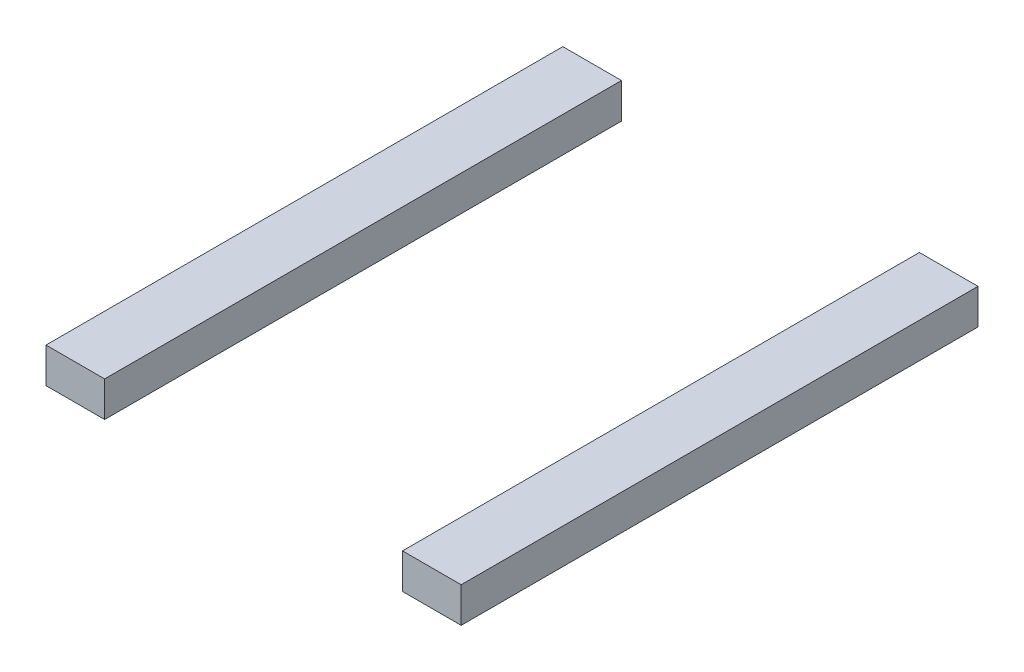
ISO-10303-21;
HEADER;
FILE_DESCRIPTION(('STEP AP214'),'2;1');
FILE_NAME('part.step','',(''),(''),'','','');
FILE_SCHEMA(('AUTOMOTIVE_DESIGN { 1 0 10303 214 1 1 1 1 }'));
ENDSEC;
DATA;
#1=APPLICATION_CONTEXT('core data for automotive mechanical design processes');
#2=APPLICATION_PROTOCOL_DEFINITION('international standard','automotive_design',2000,#1);
#3=PRODUCT_CONTEXT('',#1,'mechanical');
#4=PRODUCT('Part','Part','',(#3));
#5=PRODUCT_RELATED_PRODUCT_CATEGORY('part','',(#4));
#6=PRODUCT_DEFINITION_FORMATION('','',#4);
#7=PRODUCT_DEFINITION_CONTEXT('part definition',#1,'design');
#8=PRODUCT_DEFINITION('design','',#6,#7);
#9=PRODUCT_DEFINITION_SHAPE('','',#8);
#10=(LENGTH_UNIT() NAMED_UNIT(*) SI_UNIT(.MILLI.,.METRE.));
#11=(NAMED_UNIT(*) PLANE_ANGLE_UNIT() SI_UNIT($,.RADIAN.));
#12=(NAMED_UNIT(*) SI_UNIT($,.STERADIAN.) SOLID_ANGLE_UNIT());
#13=UNCERTAINTY_MEASURE_WITH_UNIT(LENGTH_MEASURE(1.E-05),#10,'distance_accuracy_value','');
#14=(GEOMETRIC_REPRESENTATION_CONTEXT(3) GLOBAL_UNCERTAINTY_ASSIGNED_CONTEXT((#13)) GLOBAL_UNIT_ASSIGNED_CONTEXT((#10,
#11,#12)) REPRESENTATION_CONTEXT('',''));
#15=CARTESIAN_POINT('',(0.,0.,0.));
#16=DIRECTION('',(0.,0.,1.));
#17=DIRECTION('',(1.,0.,0.));
#18=AXIS2_PLACEMENT_3D('',#15,#16,#17);
#19=CARTESIAN_POINT('',(-73.9960437855957,0.3,0.));
#20=DIRECTION('',(0.,0.,1.));
#21=DIRECTION('',(1.,0.,0.));
#22=AXIS2_PLACEMENT_3D('',#19,#20,#21);
#23=PLANE('',#22);
#24=DIRECTION('',(-1.,0.,0.));
#25=VECTOR('',#24,1.);
#26=CARTESIAN_POINT('',(-73.9960437855957,0.,0.));
#27=LINE('',#26,#25);
#28=CARTESIAN_POINT('',(-73.4960437855957,0.,0.));
#29=VERTEX_POINT('',#28);
#30=CARTESIAN_POINT('',(-73.9960437855957,0.,0.));
#31=VERTEX_POINT('',#30);
#32=EDGE_CURVE('E105',#29,#31,#27,.T.);
#33=ORIENTED_EDGE('',*,*,#32,.T.);
#34=DIRECTION('',(0.,-1.,0.));
#35=VECTOR('',#34,1.);
#36=CARTESIAN_POINT('',(-73.9960437855957,0.3,0.));
#37=LINE('',#36,#35);
#38=CARTESIAN_POINT('',(-73.9960437855957,0.3,0.));
#39=VERTEX_POINT('',#38);
#40=EDGE_CURVE('E12',#39,#31,#37,.T.);
#41=ORIENTED_EDGE('',*,*,#40,.F.);
#42=DIRECTION('',(-1.,0.,0.));
#43=VECTOR('',#42,1.);
#44=CARTESIAN_POINT('',(-73.9960437855957,0.3,0.));
#45=LINE('',#44,#43);
#46=CARTESIAN_POINT('',(-73.4960437855957,0.3,0.));
#47=VERTEX_POINT('',#46);
#48=EDGE_CURVE('E93',#47,#39,#45,.T.);
#49=ORIENTED_EDGE('',*,*,#48,.F.);
#50=DIRECTION('',(0.,-1.,0.));
#51=VECTOR('',#50,1.);
#52=CARTESIAN_POINT('',(-73.4960437855957,0.3,0.));
#53=LINE('',#52,#51);
#54=EDGE_CURVE('E101',#47,#29,#53,.T.);
#55=ORIENTED_EDGE('',*,*,#54,.T.);
#56=EDGE_LOOP('',(#33,#41,#49,#55));
#57=FACE_BOUND('',#56,.T.);
#58=ADVANCED_FACE('F42',(#57),#23,.F.);
#59=CARTESIAN_POINT('',(-73.9960437855957,0.3,0.));
#60=DIRECTION('',(1.,0.,0.));
#61=DIRECTION('',(0.,0.,-1.));
#62=AXIS2_PLACEMENT_3D('',#59,#60,#61);
#63=PLANE('',#62);
#64=DIRECTION('',(0.,0.,1.));
#65=VECTOR('',#64,1.);
#66=CARTESIAN_POINT('',(-73.9960437855957,0.,0.));
#67=LINE('',#66,#65);
#68=CARTESIAN_POINT('',(-73.9960437855957,0.,4.40709545593057));
#69=VERTEX_POINT('',#68);
#70=EDGE_CURVE('E97',#31,#69,#67,.T.);
#71=ORIENTED_EDGE('',*,*,#70,.T.);
#72=DIRECTION('',(0.,-1.,0.));
#73=VECTOR('',#72,1.);
#74=CARTESIAN_POINT('',(-73.9960437855957,0.3,4.40709545593057));
#75=LINE('',#74,#73);
#76=CARTESIAN_POINT('',(-73.9960437855957,0.3,4.40709545593057));
#77=VERTEX_POINT('',#76);
#78=EDGE_CURVE('E50',#77,#69,#75,.T.);
#79=ORIENTED_EDGE('',*,*,#78,.F.);
#80=DIRECTION('',(0.,0.,1.));
#81=VECTOR('',#80,1.);
#82=CARTESIAN_POINT('',(-73.9960437855957,0.3,0.));
#83=LINE('',#82,#81);
#84=EDGE_CURVE('E88',#39,#77,#83,.T.);
#85=ORIENTED_EDGE('',*,*,#84,.F.);
#86=ORIENTED_EDGE('',*,*,#40,.T.);
#87=EDGE_LOOP('',(#71,#79,#85,#86));
#88=FACE_BOUND('',#87,.T.);
#89=ADVANCED_FACE('F96',(#88),#63,.F.);
#90=CARTESIAN_POINT('',(-73.4960437855957,0.3,4.40709545593057));
#91=DIRECTION('',(0.,0.,-1.));
#92=DIRECTION('',(-1.,0.,0.));
#93=AXIS2_PLACEMENT_3D('',#90,#91,#92);
#94=PLANE('',#93);
#95=DIRECTION('',(1.,0.,0.));
#96=VECTOR('',#95,1.);
#97=CARTESIAN_POINT('',(-73.4960437855957,0.,4.40709545593057));
#98=LINE('',#97,#96);
#99=CARTESIAN_POINT('',(-73.4960437855957,0.,4.40709545593057));
#100=VERTEX_POINT('',#99);
#101=EDGE_CURVE('E75',#69,#100,#98,.T.);
#102=ORIENTED_EDGE('',*,*,#101,.T.);
#103=DIRECTION('',(0.,-1.,0.));
#104=VECTOR('',#103,1.);
#105=CARTESIAN_POINT('',(-73.4960437855957,0.3,4.40709545593057));
#106=LINE('',#105,#104);
#107=CARTESIAN_POINT('',(-73.4960437855957,0.3,4.40709545593057));
#108=VERTEX_POINT('',#107);
#109=EDGE_CURVE('E98',#108,#100,#106,.T.);
#110=ORIENTED_EDGE('',*,*,#109,.F.);
#111=DIRECTION('',(1.,0.,0.));
#112=VECTOR('',#111,1.);
#113=CARTESIAN_POINT('',(-73.4960437855957,0.3,4.40709545593057));
#114=LINE('',#113,#112);
#115=EDGE_CURVE('E91',#77,#108,#114,.T.);
#116=ORIENTED_EDGE('',*,*,#115,.F.);
#117=ORIENTED_EDGE('',*,*,#78,.T.);
#118=EDGE_LOOP('',(#102,#110,#116,#117));
#119=FACE_BOUND('',#118,.T.);
#120=ADVANCED_FACE('F99',(#119),#94,.F.);
#121=CARTESIAN_POINT('',(-73.4960437855957,0.3,0.));
#122=DIRECTION('',(-1.,0.,0.));
#123=DIRECTION('',(0.,0.,1.));
#124=AXIS2_PLACEMENT_3D('',#121,#122,#123);
#125=PLANE('',#124);
#126=DIRECTION('',(0.,0.,-1.));
#127=VECTOR('',#126,1.);
#128=CARTESIAN_POINT('',(-73.4960437855957,0.,0.));
#129=LINE('',#128,#127);
#130=EDGE_CURVE('E81',#100,#29,#129,.T.);
#131=ORIENTED_EDGE('',*,*,#130,.T.);
#132=ORIENTED_EDGE('',*,*,#54,.F.);
#133=DIRECTION('',(0.,0.,-1.));
#134=VECTOR('',#133,1.);
#135=CARTESIAN_POINT('',(-73.4960437855957,0.3,0.));
#136=LINE('',#135,#134);
#137=EDGE_CURVE('E58',#108,#47,#136,.T.);
#138=ORIENTED_EDGE('',*,*,#137,.F.);
#139=ORIENTED_EDGE('',*,*,#109,.T.);
#140=EDGE_LOOP('',(#131,#132,#138,#139));
#141=FACE_BOUND('',#140,.T.);
#142=ADVANCED_FACE('F112',(#141),#125,.F.);
#143=CARTESIAN_POINT('',(0.,0.3,0.));
#144=DIRECTION('',(0.,-1.,0.));
#145=DIRECTION('',(0.,0.,-1.));
#146=AXIS2_PLACEMENT_3D('',#143,#144,#145);
#147=PLANE('',#146);
#148=ORIENTED_EDGE('',*,*,#48,.T.);
#149=ORIENTED_EDGE('',*,*,#84,.T.);
#150=ORIENTED_EDGE('',*,*,#115,.T.);
#151=ORIENTED_EDGE('',*,*,#137,.T.);
#152=EDGE_LOOP('',(#148,#149,#150,#151));
#153=FACE_BOUND('',#152,.T.);
#154=ADVANCED_FACE('F89',(#153),#147,.F.);
#155=CARTESIAN_POINT('',(0.,0.,0.));
#156=DIRECTION('',(0.,-1.,0.));
#157=DIRECTION('',(0.,0.,-1.));
#158=AXIS2_PLACEMENT_3D('',#155,#156,#157);
#159=PLANE('',#158);
#160=ORIENTED_EDGE('',*,*,#32,.F.);
#161=ORIENTED_EDGE('',*,*,#130,.F.);
#162=ORIENTED_EDGE('',*,*,#101,.F.);
#163=ORIENTED_EDGE('',*,*,#70,.F.);
#164=EDGE_LOOP('',(#160,#161,#162,#163));
#165=FACE_BOUND('',#164,.T.);
#166=ADVANCED_FACE('F115',(#165),#159,.T.);
#167=CLOSED_SHELL('',(#58,#89,#120,#142,#154,#166));
#168=MANIFOLD_SOLID_BREP('B2',#167);
#169=CARTESIAN_POINT('',(-77.0360437855957,0.3,4.40709545593057));
#170=DIRECTION('',(1.,0.,0.));
#171=DIRECTION('',(0.,0.,-1.));
#172=AXIS2_PLACEMENT_3D('',#169,#170,#171);
#173=PLANE('',#172);
#174=DIRECTION('',(0.,0.,1.));
#175=VECTOR('',#174,1.);
#176=CARTESIAN_POINT('',(-77.0360437855957,0.,4.40709545593057));
#177=LINE('',#176,#175);
#178=CARTESIAN_POINT('',(-77.0360437855957,0.,0.));
#179=VERTEX_POINT('',#178);
#180=CARTESIAN_POINT('',(-77.0360437855957,0.,4.40709545593057));
#181=VERTEX_POINT('',#180);
#182=EDGE_CURVE('E228',#179,#181,#177,.T.);
#183=ORIENTED_EDGE('',*,*,#182,.T.);
#184=DIRECTION('',(0.,-1.,0.));
#185=VECTOR('',#184,1.);
#186=CARTESIAN_POINT('',(-77.0360437855957,0.3,4.40709545593057));
#187=LINE('',#186,#185);
#188=CARTESIAN_POINT('',(-77.0360437855957,0.3,4.40709545593057));
#189=VERTEX_POINT('',#188);
#190=EDGE_CURVE('E40',#189,#181,#187,.T.);
#191=ORIENTED_EDGE('',*,*,#190,.F.);
#192=DIRECTION('',(0.,0.,1.));
#193=VECTOR('',#192,1.);
#194=CARTESIAN_POINT('',(-77.0360437855957,0.3,4.40709545593057));
#195=LINE('',#194,#193);
#196=CARTESIAN_POINT('',(-77.0360437855957,0.3,0.));
#197=VERTEX_POINT('',#196);
#198=EDGE_CURVE('E216',#197,#189,#195,.T.);
#199=ORIENTED_EDGE('',*,*,#198,.F.);
#200=DIRECTION('',(0.,-1.,0.));
#201=VECTOR('',#200,1.);
#202=CARTESIAN_POINT('',(-77.0360437855957,0.3,0.));
#203=LINE('',#202,#201);
#204=EDGE_CURVE('E224',#197,#179,#203,.T.);
#205=ORIENTED_EDGE('',*,*,#204,.T.);
#206=EDGE_LOOP('',(#183,#191,#199,#205));
#207=FACE_BOUND('',#206,.T.);
#208=ADVANCED_FACE('F165',(#207),#173,.F.);
#209=CARTESIAN_POINT('',(-76.5360437855957,0.3,4.40709545593057));
#210=DIRECTION('',(0.,0.,-1.));
#211=DIRECTION('',(-1.,0.,0.));
#212=AXIS2_PLACEMENT_3D('',#209,#210,#211);
#213=PLANE('',#212);
#214=DIRECTION('',(1.,0.,0.));
#215=VECTOR('',#214,1.);
#216=CARTESIAN_POINT('',(-76.5360437855957,0.,4.40709545593057));
#217=LINE('',#216,#215);
#218=CARTESIAN_POINT('',(-76.5360437855957,0.,4.40709545593057));
#219=VERTEX_POINT('',#218);
#220=EDGE_CURVE('E220',#181,#219,#217,.T.);
#221=ORIENTED_EDGE('',*,*,#220,.T.);
#222=DIRECTION('',(0.,-1.,0.));
#223=VECTOR('',#222,1.);
#224=CARTESIAN_POINT('',(-76.5360437855957,0.3,4.40709545593057));
#225=LINE('',#224,#223);
#226=CARTESIAN_POINT('',(-76.5360437855957,0.3,4.40709545593057));
#227=VERTEX_POINT('',#226);
#228=EDGE_CURVE('E173',#227,#219,#225,.T.);
#229=ORIENTED_EDGE('',*,*,#228,.F.);
#230=DIRECTION('',(1.,0.,0.));
#231=VECTOR('',#230,1.);
#232=CARTESIAN_POINT('',(-76.5360437855957,0.3,4.40709545593057));
#233=LINE('',#232,#231);
#234=EDGE_CURVE('E211',#189,#227,#233,.T.);
#235=ORIENTED_EDGE('',*,*,#234,.F.);
#236=ORIENTED_EDGE('',*,*,#190,.T.);
#237=EDGE_LOOP('',(#221,#229,#235,#236));
#238=FACE_BOUND('',#237,.T.);
#239=ADVANCED_FACE('F219',(#238),#213,.F.);
#240=CARTESIAN_POINT('',(-76.5360437855957,0.3,0.));
#241=DIRECTION('',(-1.,0.,0.));
#242=DIRECTION('',(0.,0.,1.));
#243=AXIS2_PLACEMENT_3D('',#240,#241,#242);
#244=PLANE('',#243);
#245=DIRECTION('',(0.,0.,-1.));
#246=VECTOR('',#245,1.);
#247=CARTESIAN_POINT('',(-76.5360437855957,0.,0.));
#248=LINE('',#247,#246);
#249=CARTESIAN_POINT('',(-76.5360437855957,0.,0.));
#250=VERTEX_POINT('',#249);
#251=EDGE_CURVE('E198',#219,#250,#248,.T.);
#252=ORIENTED_EDGE('',*,*,#251,.T.);
#253=DIRECTION('',(0.,-1.,0.));
#254=VECTOR('',#253,1.);
#255=CARTESIAN_POINT('',(-76.5360437855957,0.3,0.));
#256=LINE('',#255,#254);
#257=CARTESIAN_POINT('',(-76.5360437855957,0.3,0.));
#258=VERTEX_POINT('',#257);
#259=EDGE_CURVE('E221',#258,#250,#256,.T.);
#260=ORIENTED_EDGE('',*,*,#259,.F.);
#261=DIRECTION('',(0.,0.,-1.));
#262=VECTOR('',#261,1.);
#263=CARTESIAN_POINT('',(-76.5360437855957,0.3,0.));
#264=LINE('',#263,#262);
#265=EDGE_CURVE('E214',#227,#258,#264,.T.);
#266=ORIENTED_EDGE('',*,*,#265,.F.);
#267=ORIENTED_EDGE('',*,*,#228,.T.);
#268=EDGE_LOOP('',(#252,#260,#266,#267));
#269=FACE_BOUND('',#268,.T.);
#270=ADVANCED_FACE('F222',(#269),#244,.F.);
#271=CARTESIAN_POINT('',(-77.0360437855957,0.3,0.));
#272=DIRECTION('',(0.,0.,1.));
#273=DIRECTION('',(1.,0.,0.));
#274=AXIS2_PLACEMENT_3D('',#271,#272,#273);
#275=PLANE('',#274);
#276=DIRECTION('',(-1.,0.,0.));
#277=VECTOR('',#276,1.);
#278=CARTESIAN_POINT('',(-77.0360437855957,0.,0.));
#279=LINE('',#278,#277);
#280=EDGE_CURVE('E204',#250,#179,#279,.T.);
#281=ORIENTED_EDGE('',*,*,#280,.T.);
#282=ORIENTED_EDGE('',*,*,#204,.F.);
#283=DIRECTION('',(-1.,0.,0.));
#284=VECTOR('',#283,1.);
#285=CARTESIAN_POINT('',(-77.0360437855957,0.3,0.));
#286=LINE('',#285,#284);
#287=EDGE_CURVE('E181',#258,#197,#286,.T.);
#288=ORIENTED_EDGE('',*,*,#287,.F.);
#289=ORIENTED_EDGE('',*,*,#259,.T.);
#290=EDGE_LOOP('',(#281,#282,#288,#289));
#291=FACE_BOUND('',#290,.T.);
#292=ADVANCED_FACE('F235',(#291),#275,.F.);
#293=CARTESIAN_POINT('',(0.,0.3,0.));
#294=DIRECTION('',(0.,-1.,0.));
#295=DIRECTION('',(0.,0.,-1.));
#296=AXIS2_PLACEMENT_3D('',#293,#294,#295);
#297=PLANE('',#296);
#298=ORIENTED_EDGE('',*,*,#198,.T.);
#299=ORIENTED_EDGE('',*,*,#234,.T.);
#300=ORIENTED_EDGE('',*,*,#265,.T.);
#301=ORIENTED_EDGE('',*,*,#287,.T.);
#302=EDGE_LOOP('',(#298,#299,#300,#301));
#303=FACE_BOUND('',#302,.T.);
#304=ADVANCED_FACE('F212',(#303),#297,.F.);
#305=CARTESIAN_POINT('',(0.,0.,0.));
#306=DIRECTION('',(0.,-1.,0.));
#307=DIRECTION('',(0.,0.,-1.));
#308=AXIS2_PLACEMENT_3D('',#305,#306,#307);
#309=PLANE('',#308);
#310=ORIENTED_EDGE('',*,*,#182,.F.);
#311=ORIENTED_EDGE('',*,*,#280,.F.);
#312=ORIENTED_EDGE('',*,*,#251,.F.);
#313=ORIENTED_EDGE('',*,*,#220,.F.);
#314=EDGE_LOOP('',(#310,#311,#312,#313));
#315=FACE_BOUND('',#314,.T.);
#316=ADVANCED_FACE('F238',(#315),#309,.T.);
#317=CLOSED_SHELL('',(#208,#239,#270,#292,#304,#316));
#318=MANIFOLD_SOLID_BREP('B6',#317);
#319=ADVANCED_BREP_SHAPE_REPRESENTATION('',(#18,#168,#318),#14);
#320=SHAPE_DEFINITION_REPRESENTATION(#9,#319);
ENDSEC;
END-ISO-10303-21;
